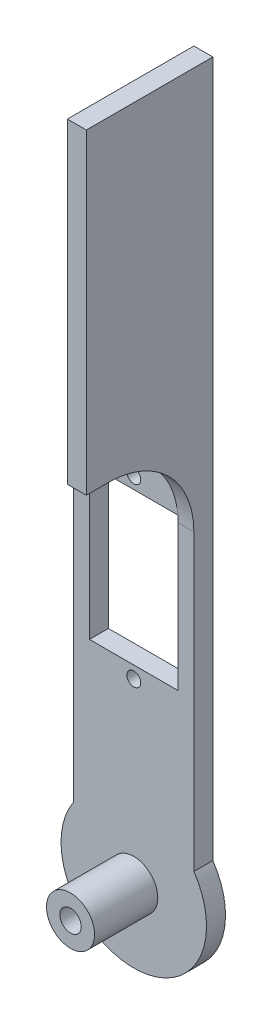
ISO-10303-21;
HEADER;
FILE_DESCRIPTION(('STEP AP214'),'2;1');
FILE_NAME('part.step','',(''),(''),'','','');
FILE_SCHEMA(('AUTOMOTIVE_DESIGN { 1 0 10303 214 1 1 1 1 }'));
ENDSEC;
DATA;
#1=APPLICATION_CONTEXT('core data for automotive mechanical design processes');
#2=APPLICATION_PROTOCOL_DEFINITION('international standard','automotive_design',2000,#1);
#3=PRODUCT_CONTEXT('',#1,'mechanical');
#4=PRODUCT('Part','Part','',(#3));
#5=PRODUCT_RELATED_PRODUCT_CATEGORY('part','',(#4));
#6=PRODUCT_DEFINITION_FORMATION('','',#4);
#7=PRODUCT_DEFINITION_CONTEXT('part definition',#1,'design');
#8=PRODUCT_DEFINITION('design','',#6,#7);
#9=PRODUCT_DEFINITION_SHAPE('','',#8);
#10=(LENGTH_UNIT() NAMED_UNIT(*) SI_UNIT(.MILLI.,.METRE.));
#11=(NAMED_UNIT(*) PLANE_ANGLE_UNIT() SI_UNIT($,.RADIAN.));
#12=(NAMED_UNIT(*) SI_UNIT($,.STERADIAN.) SOLID_ANGLE_UNIT());
#13=UNCERTAINTY_MEASURE_WITH_UNIT(LENGTH_MEASURE(1.E-05),#10,'distance_accuracy_value','');
#14=(GEOMETRIC_REPRESENTATION_CONTEXT(3) GLOBAL_UNCERTAINTY_ASSIGNED_CONTEXT((#13)) GLOBAL_UNIT_ASSIGNED_CONTEXT((#10,
#11,#12)) REPRESENTATION_CONTEXT('',''));
#15=CARTESIAN_POINT('',(0.,0.,0.));
#16=DIRECTION('',(0.,0.,1.));
#17=DIRECTION('',(1.,0.,0.));
#18=AXIS2_PLACEMENT_3D('',#15,#16,#17);
#19=CARTESIAN_POINT('',(10.1,52.9807406984079,3.));
#20=CARTESIAN_POINT('',(9.90000000000011,52.9807406984079,3.));
#21=CARTESIAN_POINT('',(9.69999999999985,52.9807406984079,3.));
#22=CARTESIAN_POINT('',(8.66666666666728,52.9807406984079,3.));
#23=CARTESIAN_POINT('',(7.8333333333339,52.9807406984079,3.));
#24=CARTESIAN_POINT('',(5.83333333333254,52.9807406984079,3.));
#25=CARTESIAN_POINT('',(4.66666666666726,52.9807406984079,3.));
#26=CARTESIAN_POINT('',(3.49999999999999,52.9807406984079,3.));
#27=CARTESIAN_POINT('',(10.1,66.4807406984079,3.));
#28=CARTESIAN_POINT('',(9.90000000000011,66.4807406984079,3.));
#29=CARTESIAN_POINT('',(9.69999999999985,66.4807406984079,3.));
#30=CARTESIAN_POINT('',(8.66666666666728,66.4807406984079,3.));
#31=CARTESIAN_POINT('',(7.8333333333339,66.4807406984079,3.));
#32=CARTESIAN_POINT('',(5.83333333333254,66.4807406984079,3.));
#33=CARTESIAN_POINT('',(4.66666666666726,66.4807406984079,3.));
#34=CARTESIAN_POINT('',(3.49999999999999,66.4807406984079,3.));
#35=CARTESIAN_POINT('',(10.1,66.4807406984079,16.5));
#36=CARTESIAN_POINT('',(9.90000000000011,66.4807406984079,16.5));
#37=CARTESIAN_POINT('',(9.69999999999985,66.4807406984079,16.5000000000003));
#38=CARTESIAN_POINT('',(8.66666666666728,66.4807406984079,16.4999999999986));
#39=CARTESIAN_POINT('',(7.8333333333339,66.4807406984079,16.5000000000014));
#40=CARTESIAN_POINT('',(5.83333333333254,66.4807406984079,16.499999999998));
#41=CARTESIAN_POINT('',(4.66666666666726,66.4807406984079,16.5));
#42=CARTESIAN_POINT('',(3.49999999999999,66.4807406984079,16.5));
#43=(BOUNDED_SURFACE() B_SPLINE_SURFACE(2,3,((#19,#20,#21,#22,#23,#24,#25,#26),(#27,#28,#29,#30,
#31,#32,#33,#34),(#35,#36,#37,#38,#39,#40,#41,#42)),.UNSPECIFIED.,.F.,.F.,
.F.) B_SPLINE_SURFACE_WITH_KNOTS((3,3),(4,2,2,4),(0.,1.),(-0.2,0.,0.833333333333332,2.),
.UNSPECIFIED.) GEOMETRIC_REPRESENTATION_ITEM() RATIONAL_B_SPLINE_SURFACE(((1.,1.,1.,1.,1.,1.,1.,
1.),(0.707106781186548,0.707106781186548,0.707106781186548,0.707106781186548,0.707106781186548,
0.707106781186548,0.707106781186548,0.707106781186548),(1.,1.,1.,1.,1.,1.,1.,1.))) REPRESENTATION_ITEM('') SURFACE());
#44=CARTESIAN_POINT('',(3.49999999999999,52.9807406984079,3.));
#45=CARTESIAN_POINT('',(4.66666666666726,52.9807406984079,3.));
#46=CARTESIAN_POINT('',(5.83333333333254,52.9807406984079,3.));
#47=CARTESIAN_POINT('',(7.8333333333339,52.9807406984079,3.));
#48=CARTESIAN_POINT('',(8.66666666666728,52.9807406984079,3.));
#49=CARTESIAN_POINT('',(9.69999999999985,52.9807406984079,3.));
#50=CARTESIAN_POINT('',(9.90000000000011,52.9807406984079,3.));
#51=CARTESIAN_POINT('',(10.1,52.9807406984079,3.));
#52=(BOUNDED_CURVE() B_SPLINE_CURVE(3,(#44,#45,#46,#47,#48,#49,#50,#51),.UNSPECIFIED.,.F.,
.F.) B_SPLINE_CURVE_WITH_KNOTS((4,2,2,4),(-0.2,0.966666666666668,1.8,2.),
.UNSPECIFIED.) CURVE() GEOMETRIC_REPRESENTATION_ITEM() RATIONAL_B_SPLINE_CURVE((1.,1.,1.,1.,1.,
1.,1.,1.)) REPRESENTATION_ITEM(''));
#53=CARTESIAN_POINT('',(9.5,52.9807406984079,3.));
#54=VERTEX_POINT('',#53);
#55=CARTESIAN_POINT('',(7.,52.9807406984079,3.));
#56=VERTEX_POINT('',#55);
#57=EDGE_CURVE('E307',#54,#56,#52,.F.);
#58=CARTESIAN_POINT('',(9.5,52.9807406984079,3.));
#59=CARTESIAN_POINT('',(9.5,66.4807406984079,3.));
#60=CARTESIAN_POINT('',(9.5,66.4807406984079,16.5));
#61=(BOUNDED_CURVE() B_SPLINE_CURVE(2,(#58,#59,#60),.UNSPECIFIED.,.F.,
.F.) B_SPLINE_CURVE_WITH_KNOTS((3,3),(0.,1.),
.UNSPECIFIED.) CURVE() GEOMETRIC_REPRESENTATION_ITEM() RATIONAL_B_SPLINE_CURVE((1.,
0.707106781186548,1.)) REPRESENTATION_ITEM(''));
#62=CARTESIAN_POINT('',(9.5,66.4807406984079,16.5));
#63=VERTEX_POINT('',#62);
#64=EDGE_CURVE('E62',#54,#63,#61,.T.);
#65=CARTESIAN_POINT('',(10.1,66.4807406984079,16.5));
#66=CARTESIAN_POINT('',(9.90000000000011,66.4807406984079,16.5));
#67=CARTESIAN_POINT('',(9.69999999999985,66.4807406984079,16.5000000000003));
#68=CARTESIAN_POINT('',(8.66666666666728,66.4807406984079,16.4999999999986));
#69=CARTESIAN_POINT('',(7.8333333333339,66.4807406984079,16.5000000000014));
#70=CARTESIAN_POINT('',(5.83333333333254,66.4807406984079,16.499999999998));
#71=CARTESIAN_POINT('',(4.66666666666726,66.4807406984079,16.5));
#72=CARTESIAN_POINT('',(3.49999999999999,66.4807406984079,16.5));
#73=(BOUNDED_CURVE() B_SPLINE_CURVE(3,(#65,#66,#67,#68,#69,#70,#71,#72),.UNSPECIFIED.,.F.,
.F.) B_SPLINE_CURVE_WITH_KNOTS((4,2,2,4),(-0.2,0.,0.833333333333332,2.),
.UNSPECIFIED.) CURVE() GEOMETRIC_REPRESENTATION_ITEM() RATIONAL_B_SPLINE_CURVE((1.,1.,1.,1.,1.,
1.,1.,1.)) REPRESENTATION_ITEM(''));
#74=CARTESIAN_POINT('',(7.,66.4807406984079,16.5));
#75=VERTEX_POINT('',#74);
#76=EDGE_CURVE('E209',#75,#63,#73,.F.);
#77=CARTESIAN_POINT('',(7.,66.4807406984079,16.5));
#78=CARTESIAN_POINT('',(7.,66.4807406984079,3.));
#79=CARTESIAN_POINT('',(7.,52.9807406984079,3.));
#80=(BOUNDED_CURVE() B_SPLINE_CURVE(2,(#77,#78,#79),.UNSPECIFIED.,.F.,
.F.) B_SPLINE_CURVE_WITH_KNOTS((3,3),(0.,1.),
.UNSPECIFIED.) CURVE() GEOMETRIC_REPRESENTATION_ITEM() RATIONAL_B_SPLINE_CURVE((1.,
0.707106781186548,1.)) REPRESENTATION_ITEM(''));
#81=EDGE_CURVE('E12',#75,#56,#80,.T.);
#82=ORIENTED_EDGE('',*,*,#57,.F.);
#83=ORIENTED_EDGE('',*,*,#64,.T.);
#84=ORIENTED_EDGE('',*,*,#76,.F.);
#85=ORIENTED_EDGE('',*,*,#81,.T.);
#86=EDGE_LOOP('',(#82,#83,#84,#85));
#87=FACE_BOUND('',#86,.T.);
#88=ADVANCED_FACE('F47',(#87),#43,.T.);
#89=CARTESIAN_POINT('',(-9.5,66.4807406984079,3.));
#90=DIRECTION('',(0.,-1.,0.));
#91=DIRECTION('',(0.,0.,-1.));
#92=AXIS2_PLACEMENT_3D('',#89,#90,#91);
#93=PLANE('',#92);
#94=DIRECTION('',(0.,0.,1.));
#95=VECTOR('',#94,1.);
#96=CARTESIAN_POINT('',(6.5,66.4807406984079,0.));
#97=LINE('',#96,#95);
#98=CARTESIAN_POINT('',(6.5,66.4807406984079,0.));
#99=VERTEX_POINT('',#98);
#100=CARTESIAN_POINT('',(6.5,66.4807406984079,3.));
#101=VERTEX_POINT('',#100);
#102=EDGE_CURVE('E184',#99,#101,#97,.T.);
#103=ORIENTED_EDGE('',*,*,#102,.F.);
#104=DIRECTION('',(-1.,0.,0.));
#105=VECTOR('',#104,1.);
#106=CARTESIAN_POINT('',(-9.5,66.4807406984079,0.));
#107=LINE('',#106,#105);
#108=CARTESIAN_POINT('',(-9.5,66.4807406984079,0.));
#109=VERTEX_POINT('',#108);
#110=EDGE_CURVE('E162',#99,#109,#107,.T.);
#111=ORIENTED_EDGE('',*,*,#110,.T.);
#112=DIRECTION('',(0.,0.,-1.));
#113=VECTOR('',#112,1.);
#114=CARTESIAN_POINT('',(-9.5,66.4807406984079,3.));
#115=LINE('',#114,#113);
#116=CARTESIAN_POINT('',(-9.5,66.4807406984079,3.));
#117=VERTEX_POINT('',#116);
#118=EDGE_CURVE('E387',#117,#109,#115,.T.);
#119=ORIENTED_EDGE('',*,*,#118,.F.);
#120=DIRECTION('',(-1.,0.,0.));
#121=VECTOR('',#120,1.);
#122=CARTESIAN_POINT('',(-9.5,66.4807406984079,3.));
#123=LINE('',#122,#121);
#124=EDGE_CURVE('E374',#101,#117,#123,.T.);
#125=ORIENTED_EDGE('',*,*,#124,.F.);
#126=EDGE_LOOP('',(#103,#111,#119,#125));
#127=FACE_BOUND('',#126,.T.);
#128=ADVANCED_FACE('F280',(#127),#93,.F.);
#129=CARTESIAN_POINT('',(0.,0.,3.));
#130=DIRECTION('',(0.,0.,-1.));
#131=DIRECTION('',(-1.,0.,0.));
#132=AXIS2_PLACEMENT_3D('',#129,#130,#131);
#133=CYLINDRICAL_SURFACE('',#132,11.5);
#134=CARTESIAN_POINT('',(0.,0.,0.));
#135=DIRECTION('',(0.,0.,1.));
#136=DIRECTION('',(1.,0.,0.));
#137=AXIS2_PLACEMENT_3D('',#134,#135,#136);
#138=CIRCLE('',#137,11.5);
#139=CARTESIAN_POINT('',(-9.5,6.48074069840786,0.));
#140=VERTEX_POINT('',#139);
#141=CARTESIAN_POINT('',(9.5,6.48074069840786,0.));
#142=VERTEX_POINT('',#141);
#143=EDGE_CURVE('E163',#140,#142,#138,.T.);
#144=ORIENTED_EDGE('',*,*,#143,.T.);
#145=DIRECTION('',(0.,0.,-1.));
#146=VECTOR('',#145,1.);
#147=CARTESIAN_POINT('',(9.5,6.48074069840786,3.));
#148=LINE('',#147,#146);
#149=CARTESIAN_POINT('',(9.5,6.48074069840786,3.));
#150=VERTEX_POINT('',#149);
#151=EDGE_CURVE('E157',#150,#142,#148,.T.);
#152=ORIENTED_EDGE('',*,*,#151,.F.);
#153=CARTESIAN_POINT('',(0.,0.,3.));
#154=DIRECTION('',(0.,0.,1.));
#155=DIRECTION('',(1.,0.,0.));
#156=AXIS2_PLACEMENT_3D('',#153,#154,#155);
#157=CIRCLE('',#156,11.5);
#158=CARTESIAN_POINT('',(-9.5,6.48074069840786,3.));
#159=VERTEX_POINT('',#158);
#160=EDGE_CURVE('E365',#159,#150,#157,.T.);
#161=ORIENTED_EDGE('',*,*,#160,.F.);
#162=DIRECTION('',(0.,0.,-1.));
#163=VECTOR('',#162,1.);
#164=CARTESIAN_POINT('',(-9.5,6.48074069840786,3.));
#165=LINE('',#164,#163);
#166=EDGE_CURVE('E377',#159,#140,#165,.T.);
#167=ORIENTED_EDGE('',*,*,#166,.T.);
#168=EDGE_LOOP('',(#144,#152,#161,#167));
#169=FACE_BOUND('',#168,.T.);
#170=ADVANCED_FACE('F283',(#169),#133,.T.);
#171=CARTESIAN_POINT('',(9.5,6.48074069840786,3.));
#172=DIRECTION('',(-1.,0.,0.));
#173=DIRECTION('',(0.,0.,1.));
#174=AXIS2_PLACEMENT_3D('',#171,#172,#173);
#175=PLANE('',#174);
#176=DIRECTION('',(0.,1.,0.));
#177=VECTOR('',#176,1.);
#178=CARTESIAN_POINT('',(9.5,6.48074069840786,0.));
#179=LINE('',#178,#177);
#180=CARTESIAN_POINT('',(9.5,116.480740698408,0.));
#181=VERTEX_POINT('',#180);
#182=EDGE_CURVE('E150',#142,#181,#179,.T.);
#183=ORIENTED_EDGE('',*,*,#182,.T.);
#184=DIRECTION('',(0.,0.,-1.));
#185=VECTOR('',#184,1.);
#186=CARTESIAN_POINT('',(9.5,116.480740698408,0.));
#187=LINE('',#186,#185);
#188=CARTESIAN_POINT('',(9.5,116.480740698408,20.));
#189=VERTEX_POINT('',#188);
#190=EDGE_CURVE('E155',#189,#181,#187,.T.);
#191=ORIENTED_EDGE('',*,*,#190,.F.);
#192=DIRECTION('',(0.,-1.,0.));
#193=VECTOR('',#192,1.);
#194=CARTESIAN_POINT('',(9.5,116.480740698408,20.));
#195=LINE('',#194,#193);
#196=CARTESIAN_POINT('',(9.5,66.4807406984079,20.));
#197=VERTEX_POINT('',#196);
#198=EDGE_CURVE('E191',#189,#197,#195,.T.);
#199=ORIENTED_EDGE('',*,*,#198,.T.);
#200=DIRECTION('',(0.,0.,-1.));
#201=VECTOR('',#200,1.);
#202=CARTESIAN_POINT('',(9.5,66.4807406984079,0.));
#203=LINE('',#202,#201);
#204=EDGE_CURVE('E195',#197,#63,#203,.T.);
#205=ORIENTED_EDGE('',*,*,#204,.T.);
#206=ORIENTED_EDGE('',*,*,#64,.F.);
#207=DIRECTION('',(0.,1.,0.));
#208=VECTOR('',#207,1.);
#209=CARTESIAN_POINT('',(9.5,6.48074069840786,3.));
#210=LINE('',#209,#208);
#211=EDGE_CURVE('E317',#150,#54,#210,.T.);
#212=ORIENTED_EDGE('',*,*,#211,.F.);
#213=ORIENTED_EDGE('',*,*,#151,.T.);
#214=EDGE_LOOP('',(#183,#191,#199,#205,#206,#212,#213));
#215=FACE_BOUND('',#214,.T.);
#216=ADVANCED_FACE('F152',(#215),#175,.F.);
#217=CARTESIAN_POINT('',(-9.5,6.48074069840786,3.));
#218=DIRECTION('',(1.,0.,0.));
#219=DIRECTION('',(0.,0.,-1.));
#220=AXIS2_PLACEMENT_3D('',#217,#218,#219);
#221=PLANE('',#220);
#222=DIRECTION('',(0.,-1.,0.));
#223=VECTOR('',#222,1.);
#224=CARTESIAN_POINT('',(-9.5,6.48074069840786,0.));
#225=LINE('',#224,#223);
#226=EDGE_CURVE('E367',#109,#140,#225,.T.);
#227=ORIENTED_EDGE('',*,*,#226,.T.);
#228=ORIENTED_EDGE('',*,*,#166,.F.);
#229=DIRECTION('',(0.,-1.,0.));
#230=VECTOR('',#229,1.);
#231=CARTESIAN_POINT('',(-9.5,6.48074069840786,3.));
#232=LINE('',#231,#230);
#233=EDGE_CURVE('E373',#117,#159,#232,.T.);
#234=ORIENTED_EDGE('',*,*,#233,.F.);
#235=ORIENTED_EDGE('',*,*,#118,.T.);
#236=EDGE_LOOP('',(#227,#228,#234,#235));
#237=FACE_BOUND('',#236,.T.);
#238=ADVANCED_FACE('F272',(#237),#221,.F.);
#239=CARTESIAN_POINT('',(0.,0.,3.));
#240=DIRECTION('',(0.,0.,1.));
#241=DIRECTION('',(1.,0.,0.));
#242=AXIS2_PLACEMENT_3D('',#239,#240,#241);
#243=PLANE('',#242);
#244=CARTESIAN_POINT('',(0.,55.9,3.));
#245=DIRECTION('',(0.,0.,1.));
#246=DIRECTION('',(1.,0.,0.));
#247=AXIS2_PLACEMENT_3D('',#244,#245,#246);
#248=CIRCLE('',#247,1.1);
#249=CARTESIAN_POINT('',(1.1,55.9,3.));
#250=VERTEX_POINT('',#249);
#251=EDGE_CURVE('E349',#250,#250,#248,.T.);
#252=ORIENTED_EDGE('',*,*,#251,.F.);
#253=EDGE_LOOP('',(#252));
#254=FACE_BOUND('',#253,.T.);
#255=CARTESIAN_POINT('',(0.,28.1,3.));
#256=DIRECTION('',(0.,0.,1.));
#257=DIRECTION('',(1.,0.,0.));
#258=AXIS2_PLACEMENT_3D('',#255,#256,#257);
#259=CIRCLE('',#258,1.1);
#260=CARTESIAN_POINT('',(1.1,28.1,3.));
#261=VERTEX_POINT('',#260);
#262=EDGE_CURVE('E345',#261,#261,#259,.T.);
#263=ORIENTED_EDGE('',*,*,#262,.F.);
#264=EDGE_LOOP('',(#263));
#265=FACE_BOUND('',#264,.T.);
#266=ORIENTED_EDGE('',*,*,#211,.T.);
#267=ORIENTED_EDGE('',*,*,#57,.T.);
#268=DIRECTION('',(0.,1.,0.));
#269=VECTOR('',#268,1.);
#270=CARTESIAN_POINT('',(7.,0.,3.));
#271=LINE('',#270,#269);
#272=CARTESIAN_POINT('',(7.,30.,3.));
#273=VERTEX_POINT('',#272);
#274=EDGE_CURVE('E315',#273,#56,#271,.T.);
#275=ORIENTED_EDGE('',*,*,#274,.F.);
#276=DIRECTION('',(1.,0.,0.));
#277=VECTOR('',#276,1.);
#278=CARTESIAN_POINT('',(0.,30.,3.));
#279=LINE('',#278,#277);
#280=CARTESIAN_POINT('',(-7.,30.,3.));
#281=VERTEX_POINT('',#280);
#282=EDGE_CURVE('E325',#281,#273,#279,.T.);
#283=ORIENTED_EDGE('',*,*,#282,.F.);
#284=DIRECTION('',(0.,-1.,0.));
#285=VECTOR('',#284,1.);
#286=CARTESIAN_POINT('',(-7.,0.,3.));
#287=LINE('',#286,#285);
#288=CARTESIAN_POINT('',(-7.,54.,3.));
#289=VERTEX_POINT('',#288);
#290=EDGE_CURVE('E330',#289,#281,#287,.T.);
#291=ORIENTED_EDGE('',*,*,#290,.F.);
#292=DIRECTION('',(-1.,0.,0.));
#293=VECTOR('',#292,1.);
#294=CARTESIAN_POINT('',(0.,54.,3.));
#295=LINE('',#294,#293);
#296=CARTESIAN_POINT('',(7.,54.,3.));
#297=VERTEX_POINT('',#296);
#298=EDGE_CURVE('E326',#297,#289,#295,.T.);
#299=ORIENTED_EDGE('',*,*,#298,.F.);
#300=DIRECTION('',(0.,1.,0.));
#301=VECTOR('',#300,1.);
#302=CARTESIAN_POINT('',(7.,0.,3.));
#303=LINE('',#302,#301);
#304=CARTESIAN_POINT('',(7.,66.4807406984079,3.));
#305=VERTEX_POINT('',#304);
#306=EDGE_CURVE('E319',#297,#305,#303,.T.);
#307=ORIENTED_EDGE('',*,*,#306,.T.);
#308=EDGE_CURVE('E370',#305,#101,#123,.T.);
#309=ORIENTED_EDGE('',*,*,#308,.T.);
#310=ORIENTED_EDGE('',*,*,#124,.T.);
#311=ORIENTED_EDGE('',*,*,#233,.T.);
#312=ORIENTED_EDGE('',*,*,#160,.T.);
#313=EDGE_LOOP('',(#266,#267,#275,#283,#291,#299,#307,#309,#310,#311,#312));
#314=FACE_BOUND('',#313,.T.);
#315=CARTESIAN_POINT('',(0.,0.,3.));
#316=DIRECTION('',(0.,0.,1.));
#317=DIRECTION('',(1.,0.,0.));
#318=AXIS2_PLACEMENT_3D('',#315,#316,#317);
#319=CIRCLE('',#318,3.8);
#320=CARTESIAN_POINT('',(3.8,0.,3.));
#321=VERTEX_POINT('',#320);
#322=EDGE_CURVE('E361',#321,#321,#319,.T.);
#323=ORIENTED_EDGE('',*,*,#322,.F.);
#324=EDGE_LOOP('',(#323));
#325=FACE_BOUND('',#324,.T.);
#326=ADVANCED_FACE('F268',(#254,#265,#314,#325),#243,.T.);
#327=CARTESIAN_POINT('',(0.,0.,0.));
#328=DIRECTION('',(0.,0.,1.));
#329=DIRECTION('',(1.,0.,0.));
#330=AXIS2_PLACEMENT_3D('',#327,#328,#329);
#331=PLANE('',#330);
#332=CARTESIAN_POINT('',(0.,55.9,0.));
#333=DIRECTION('',(0.,0.,-1.));
#334=DIRECTION('',(1.,0.,0.));
#335=AXIS2_PLACEMENT_3D('',#332,#333,#334);
#336=CIRCLE('',#335,1.1);
#337=CARTESIAN_POINT('',(1.1,55.9,0.));
#338=VERTEX_POINT('',#337);
#339=EDGE_CURVE('E553',#338,#338,#336,.T.);
#340=ORIENTED_EDGE('',*,*,#339,.F.);
#341=EDGE_LOOP('',(#340));
#342=FACE_BOUND('',#341,.T.);
#343=CARTESIAN_POINT('',(0.,28.1,0.));
#344=DIRECTION('',(0.,0.,-1.));
#345=DIRECTION('',(-1.,0.,0.));
#346=AXIS2_PLACEMENT_3D('',#343,#344,#345);
#347=CIRCLE('',#346,1.1);
#348=CARTESIAN_POINT('',(-1.1,28.1,0.));
#349=VERTEX_POINT('',#348);
#350=EDGE_CURVE('E559',#349,#349,#347,.T.);
#351=ORIENTED_EDGE('',*,*,#350,.F.);
#352=EDGE_LOOP('',(#351));
#353=FACE_BOUND('',#352,.T.);
#354=DIRECTION('',(1.,0.,0.));
#355=VECTOR('',#354,1.);
#356=CARTESIAN_POINT('',(-7.,54.,0.));
#357=LINE('',#356,#355);
#358=CARTESIAN_POINT('',(-7.,54.,0.));
#359=VERTEX_POINT('',#358);
#360=CARTESIAN_POINT('',(7.,54.,0.));
#361=VERTEX_POINT('',#360);
#362=EDGE_CURVE('E570',#359,#361,#357,.T.);
#363=ORIENTED_EDGE('',*,*,#362,.F.);
#364=DIRECTION('',(0.,1.,0.));
#365=VECTOR('',#364,1.);
#366=CARTESIAN_POINT('',(-7.,30.,0.));
#367=LINE('',#366,#365);
#368=CARTESIAN_POINT('',(-7.,30.,0.));
#369=VERTEX_POINT('',#368);
#370=EDGE_CURVE('E566',#369,#359,#367,.T.);
#371=ORIENTED_EDGE('',*,*,#370,.F.);
#372=DIRECTION('',(-1.,0.,0.));
#373=VECTOR('',#372,1.);
#374=CARTESIAN_POINT('',(-7.,30.,0.));
#375=LINE('',#374,#373);
#376=CARTESIAN_POINT('',(7.,30.,0.));
#377=VERTEX_POINT('',#376);
#378=EDGE_CURVE('E577',#377,#369,#375,.T.);
#379=ORIENTED_EDGE('',*,*,#378,.F.);
#380=DIRECTION('',(0.,-1.,0.));
#381=VECTOR('',#380,1.);
#382=CARTESIAN_POINT('',(7.,30.,0.));
#383=LINE('',#382,#381);
#384=EDGE_CURVE('E574',#361,#377,#383,.T.);
#385=ORIENTED_EDGE('',*,*,#384,.F.);
#386=EDGE_LOOP('',(#363,#371,#379,#385));
#387=FACE_BOUND('',#386,.T.);
#388=CARTESIAN_POINT('',(0.,0.,0.));
#389=DIRECTION('',(0.,0.,-1.));
#390=DIRECTION('',(-1.,0.,0.));
#391=AXIS2_PLACEMENT_3D('',#388,#389,#390);
#392=CIRCLE('',#391,1.7);
#393=CARTESIAN_POINT('',(-1.7,0.,0.));
#394=VERTEX_POINT('',#393);
#395=EDGE_CURVE('E353',#394,#394,#392,.T.);
#396=ORIENTED_EDGE('',*,*,#395,.F.);
#397=EDGE_LOOP('',(#396));
#398=FACE_BOUND('',#397,.T.);
#399=ORIENTED_EDGE('',*,*,#143,.F.);
#400=ORIENTED_EDGE('',*,*,#226,.F.);
#401=ORIENTED_EDGE('',*,*,#110,.F.);
#402=DIRECTION('',(0.,-1.,0.));
#403=VECTOR('',#402,1.);
#404=CARTESIAN_POINT('',(6.5,116.480740698408,0.));
#405=LINE('',#404,#403);
#406=CARTESIAN_POINT('',(6.5,116.480740698408,0.));
#407=VERTEX_POINT('',#406);
#408=EDGE_CURVE('E170',#407,#99,#405,.T.);
#409=ORIENTED_EDGE('',*,*,#408,.F.);
#410=DIRECTION('',(-1.,0.,0.));
#411=VECTOR('',#410,1.);
#412=CARTESIAN_POINT('',(9.5,116.480740698408,0.));
#413=LINE('',#412,#411);
#414=EDGE_CURVE('E166',#181,#407,#413,.T.);
#415=ORIENTED_EDGE('',*,*,#414,.F.);
#416=ORIENTED_EDGE('',*,*,#182,.F.);
#417=EDGE_LOOP('',(#399,#400,#401,#409,#415,#416));
#418=FACE_BOUND('',#417,.T.);
#419=ADVANCED_FACE('F167',(#342,#353,#387,#398,#418),#331,.F.);
#420=CARTESIAN_POINT('',(0.,0.,13.));
#421=DIRECTION('',(0.,0.,-1.));
#422=DIRECTION('',(-1.,0.,0.));
#423=AXIS2_PLACEMENT_3D('',#420,#421,#422);
#424=CYLINDRICAL_SURFACE('',#423,3.8);
#425=CARTESIAN_POINT('',(0.,0.,13.));
#426=DIRECTION('',(0.,0.,1.));
#427=DIRECTION('',(1.,0.,0.));
#428=AXIS2_PLACEMENT_3D('',#425,#426,#427);
#429=CIRCLE('',#428,3.8);
#430=CARTESIAN_POINT('',(3.8,0.,13.));
#431=VERTEX_POINT('',#430);
#432=EDGE_CURVE('E357',#431,#431,#429,.T.);
#433=ORIENTED_EDGE('',*,*,#432,.F.);
#434=EDGE_LOOP('',(#433));
#435=FACE_BOUND('',#434,.T.);
#436=ORIENTED_EDGE('',*,*,#322,.T.);
#437=EDGE_LOOP('',(#436));
#438=FACE_BOUND('',#437,.T.);
#439=ADVANCED_FACE('F264',(#435,#438),#424,.T.);
#440=CARTESIAN_POINT('',(0.,0.,13.));
#441=DIRECTION('',(0.,0.,1.));
#442=DIRECTION('',(1.,0.,0.));
#443=AXIS2_PLACEMENT_3D('',#440,#441,#442);
#444=PLANE('',#443);
#445=CARTESIAN_POINT('',(0.,0.,13.));
#446=DIRECTION('',(0.,0.,1.));
#447=DIRECTION('',(1.,0.,0.));
#448=AXIS2_PLACEMENT_3D('',#445,#446,#447);
#449=CIRCLE('',#448,1.7);
#450=CARTESIAN_POINT('',(1.7,0.,13.));
#451=VERTEX_POINT('',#450);
#452=EDGE_CURVE('E337',#451,#451,#449,.T.);
#453=ORIENTED_EDGE('',*,*,#452,.F.);
#454=EDGE_LOOP('',(#453));
#455=FACE_BOUND('',#454,.T.);
#456=ORIENTED_EDGE('',*,*,#432,.T.);
#457=EDGE_LOOP('',(#456));
#458=FACE_BOUND('',#457,.T.);
#459=ADVANCED_FACE('F260',(#455,#458),#444,.T.);
#460=CARTESIAN_POINT('',(0.,0.,20.));
#461=DIRECTION('',(0.,0.,-1.));
#462=DIRECTION('',(-1.,0.,0.));
#463=AXIS2_PLACEMENT_3D('',#460,#461,#462);
#464=CYLINDRICAL_SURFACE('',#463,1.7);
#465=ORIENTED_EDGE('',*,*,#452,.T.);
#466=EDGE_LOOP('',(#465));
#467=FACE_BOUND('',#466,.T.);
#468=ORIENTED_EDGE('',*,*,#395,.T.);
#469=EDGE_LOOP('',(#468));
#470=FACE_BOUND('',#469,.T.);
#471=ADVANCED_FACE('F256',(#467,#470),#464,.F.);
#472=CARTESIAN_POINT('',(-7.,30.,20.));
#473=DIRECTION('',(-1.,0.,0.));
#474=DIRECTION('',(0.,-1.,0.));
#475=AXIS2_PLACEMENT_3D('',#472,#473,#474);
#476=PLANE('',#475);
#477=ORIENTED_EDGE('',*,*,#290,.T.);
#478=DIRECTION('',(0.,0.,-1.));
#479=VECTOR('',#478,1.);
#480=CARTESIAN_POINT('',(-7.,30.,20.));
#481=LINE('',#480,#479);
#482=EDGE_CURVE('E332',#281,#369,#481,.T.);
#483=ORIENTED_EDGE('',*,*,#482,.T.);
#484=ORIENTED_EDGE('',*,*,#370,.T.);
#485=DIRECTION('',(0.,0.,-1.));
#486=VECTOR('',#485,1.);
#487=CARTESIAN_POINT('',(-7.,54.,20.));
#488=LINE('',#487,#486);
#489=EDGE_CURVE('E581',#289,#359,#488,.T.);
#490=ORIENTED_EDGE('',*,*,#489,.F.);
#491=EDGE_LOOP('',(#477,#483,#484,#490));
#492=FACE_BOUND('',#491,.T.);
#493=ADVANCED_FACE('F246',(#492),#476,.F.);
#494=CARTESIAN_POINT('',(-7.,30.,20.));
#495=DIRECTION('',(0.,-1.,0.));
#496=DIRECTION('',(0.,0.,-1.));
#497=AXIS2_PLACEMENT_3D('',#494,#495,#496);
#498=PLANE('',#497);
#499=ORIENTED_EDGE('',*,*,#282,.T.);
#500=DIRECTION('',(0.,0.,-1.));
#501=VECTOR('',#500,1.);
#502=CARTESIAN_POINT('',(7.,30.,20.));
#503=LINE('',#502,#501);
#504=EDGE_CURVE('E323',#273,#377,#503,.T.);
#505=ORIENTED_EDGE('',*,*,#504,.T.);
#506=ORIENTED_EDGE('',*,*,#378,.T.);
#507=ORIENTED_EDGE('',*,*,#482,.F.);
#508=EDGE_LOOP('',(#499,#505,#506,#507));
#509=FACE_BOUND('',#508,.T.);
#510=ADVANCED_FACE('F243',(#509),#498,.F.);
#511=CARTESIAN_POINT('',(7.,30.,20.));
#512=DIRECTION('',(1.,0.,0.));
#513=DIRECTION('',(0.,1.,0.));
#514=AXIS2_PLACEMENT_3D('',#511,#512,#513);
#515=PLANE('',#514);
#516=ORIENTED_EDGE('',*,*,#274,.T.);
#517=ORIENTED_EDGE('',*,*,#81,.F.);
#518=DIRECTION('',(0.,0.,1.));
#519=VECTOR('',#518,1.);
#520=CARTESIAN_POINT('',(7.,66.4807406984079,0.));
#521=LINE('',#520,#519);
#522=EDGE_CURVE('E214',#305,#75,#521,.T.);
#523=ORIENTED_EDGE('',*,*,#522,.F.);
#524=ORIENTED_EDGE('',*,*,#306,.F.);
#525=DIRECTION('',(0.,0.,-1.));
#526=VECTOR('',#525,1.);
#527=CARTESIAN_POINT('',(7.,54.,20.));
#528=LINE('',#527,#526);
#529=EDGE_CURVE('E586',#297,#361,#528,.T.);
#530=ORIENTED_EDGE('',*,*,#529,.T.);
#531=ORIENTED_EDGE('',*,*,#384,.T.);
#532=ORIENTED_EDGE('',*,*,#504,.F.);
#533=EDGE_LOOP('',(#516,#517,#523,#524,#530,#531,#532));
#534=FACE_BOUND('',#533,.T.);
#535=ADVANCED_FACE('F245',(#534),#515,.F.);
#536=CARTESIAN_POINT('',(-7.,54.,20.));
#537=DIRECTION('',(0.,1.,0.));
#538=DIRECTION('',(0.,0.,1.));
#539=AXIS2_PLACEMENT_3D('',#536,#537,#538);
#540=PLANE('',#539);
#541=ORIENTED_EDGE('',*,*,#298,.T.);
#542=ORIENTED_EDGE('',*,*,#489,.T.);
#543=ORIENTED_EDGE('',*,*,#362,.T.);
#544=ORIENTED_EDGE('',*,*,#529,.F.);
#545=EDGE_LOOP('',(#541,#542,#543,#544));
#546=FACE_BOUND('',#545,.T.);
#547=ADVANCED_FACE('F238',(#546),#540,.F.);
#548=CARTESIAN_POINT('',(0.,28.1,20.));
#549=DIRECTION('',(0.,0.,-1.));
#550=DIRECTION('',(-1.,0.,0.));
#551=AXIS2_PLACEMENT_3D('',#548,#549,#550);
#552=CYLINDRICAL_SURFACE('',#551,1.1);
#553=ORIENTED_EDGE('',*,*,#262,.T.);
#554=EDGE_LOOP('',(#553));
#555=FACE_BOUND('',#554,.T.);
#556=ORIENTED_EDGE('',*,*,#350,.T.);
#557=EDGE_LOOP('',(#556));
#558=FACE_BOUND('',#557,.T.);
#559=ADVANCED_FACE('F235',(#555,#558),#552,.F.);
#560=CARTESIAN_POINT('',(0.,55.9,20.));
#561=DIRECTION('',(0.,0.,-1.));
#562=DIRECTION('',(-1.,0.,0.));
#563=AXIS2_PLACEMENT_3D('',#560,#561,#562);
#564=CYLINDRICAL_SURFACE('',#563,1.1);
#565=ORIENTED_EDGE('',*,*,#251,.T.);
#566=EDGE_LOOP('',(#565));
#567=FACE_BOUND('',#566,.T.);
#568=ORIENTED_EDGE('',*,*,#339,.T.);
#569=EDGE_LOOP('',(#568));
#570=FACE_BOUND('',#569,.T.);
#571=ADVANCED_FACE('F227',(#567,#570),#564,.F.);
#572=CARTESIAN_POINT('',(0.,66.4807406984079,0.));
#573=DIRECTION('',(0.,-1.,0.));
#574=DIRECTION('',(0.,0.,-1.));
#575=AXIS2_PLACEMENT_3D('',#572,#573,#574);
#576=PLANE('',#575);
#577=ORIENTED_EDGE('',*,*,#522,.T.);
#578=ORIENTED_EDGE('',*,*,#76,.T.);
#579=ORIENTED_EDGE('',*,*,#204,.F.);
#580=DIRECTION('',(1.,0.,0.));
#581=VECTOR('',#580,1.);
#582=CARTESIAN_POINT('',(9.5,66.4807406984079,20.));
#583=LINE('',#582,#581);
#584=CARTESIAN_POINT('',(6.5,66.4807406984079,20.));
#585=VERTEX_POINT('',#584);
#586=EDGE_CURVE('E181',#585,#197,#583,.T.);
#587=ORIENTED_EDGE('',*,*,#586,.F.);
#588=EDGE_CURVE('E200',#101,#585,#97,.T.);
#589=ORIENTED_EDGE('',*,*,#588,.F.);
#590=ORIENTED_EDGE('',*,*,#308,.F.);
#591=EDGE_LOOP('',(#577,#578,#579,#587,#589,#590));
#592=FACE_BOUND('',#591,.T.);
#593=ADVANCED_FACE('F216',(#592),#576,.T.);
#594=CARTESIAN_POINT('',(6.5,116.480740698408,0.));
#595=DIRECTION('',(1.,0.,0.));
#596=DIRECTION('',(0.,0.,-1.));
#597=AXIS2_PLACEMENT_3D('',#594,#595,#596);
#598=PLANE('',#597);
#599=ORIENTED_EDGE('',*,*,#102,.T.);
#600=ORIENTED_EDGE('',*,*,#588,.T.);
#601=DIRECTION('',(0.,-1.,0.));
#602=VECTOR('',#601,1.);
#603=CARTESIAN_POINT('',(6.5,116.480740698408,20.));
#604=LINE('',#603,#602);
#605=CARTESIAN_POINT('',(6.5,116.480740698408,20.));
#606=VERTEX_POINT('',#605);
#607=EDGE_CURVE('E554',#606,#585,#604,.T.);
#608=ORIENTED_EDGE('',*,*,#607,.F.);
#609=DIRECTION('',(0.,0.,1.));
#610=VECTOR('',#609,1.);
#611=CARTESIAN_POINT('',(6.5,116.480740698408,0.));
#612=LINE('',#611,#610);
#613=EDGE_CURVE('E174',#407,#606,#612,.T.);
#614=ORIENTED_EDGE('',*,*,#613,.F.);
#615=ORIENTED_EDGE('',*,*,#408,.T.);
#616=EDGE_LOOP('',(#599,#600,#608,#614,#615));
#617=FACE_BOUND('',#616,.T.);
#618=ADVANCED_FACE('F226',(#617),#598,.F.);
#619=CARTESIAN_POINT('',(9.5,116.480740698408,20.));
#620=DIRECTION('',(0.,0.,-1.));
#621=DIRECTION('',(-1.,0.,0.));
#622=AXIS2_PLACEMENT_3D('',#619,#620,#621);
#623=PLANE('',#622);
#624=ORIENTED_EDGE('',*,*,#586,.T.);
#625=ORIENTED_EDGE('',*,*,#198,.F.);
#626=DIRECTION('',(1.,0.,0.));
#627=VECTOR('',#626,1.);
#628=CARTESIAN_POINT('',(9.5,116.480740698408,20.));
#629=LINE('',#628,#627);
#630=EDGE_CURVE('E178',#606,#189,#629,.T.);
#631=ORIENTED_EDGE('',*,*,#630,.F.);
#632=ORIENTED_EDGE('',*,*,#607,.T.);
#633=EDGE_LOOP('',(#624,#625,#631,#632));
#634=FACE_BOUND('',#633,.T.);
#635=ADVANCED_FACE('F228',(#634),#623,.F.);
#636=CARTESIAN_POINT('',(0.,116.480740698408,0.));
#637=DIRECTION('',(0.,-1.,0.));
#638=DIRECTION('',(0.,0.,-1.));
#639=AXIS2_PLACEMENT_3D('',#636,#637,#638);
#640=PLANE('',#639);
#641=ORIENTED_EDGE('',*,*,#190,.T.);
#642=ORIENTED_EDGE('',*,*,#414,.T.);
#643=ORIENTED_EDGE('',*,*,#613,.T.);
#644=ORIENTED_EDGE('',*,*,#630,.T.);
#645=EDGE_LOOP('',(#641,#642,#643,#644));
#646=FACE_BOUND('',#645,.T.);
#647=ADVANCED_FACE('F176',(#646),#640,.F.);
#648=CLOSED_SHELL('',(#88,#128,#170,#216,#238,#326,#419,#439,#459,#471,#493,#510,#535,#547,#559,
#571,#593,#618,#635,#647));
#649=MANIFOLD_SOLID_BREP('B2',#648);
#650=ADVANCED_BREP_SHAPE_REPRESENTATION('',(#18,#649),#14);
#651=SHAPE_DEFINITION_REPRESENTATION(#9,#650);
ENDSEC;
END-ISO-10303-21;
